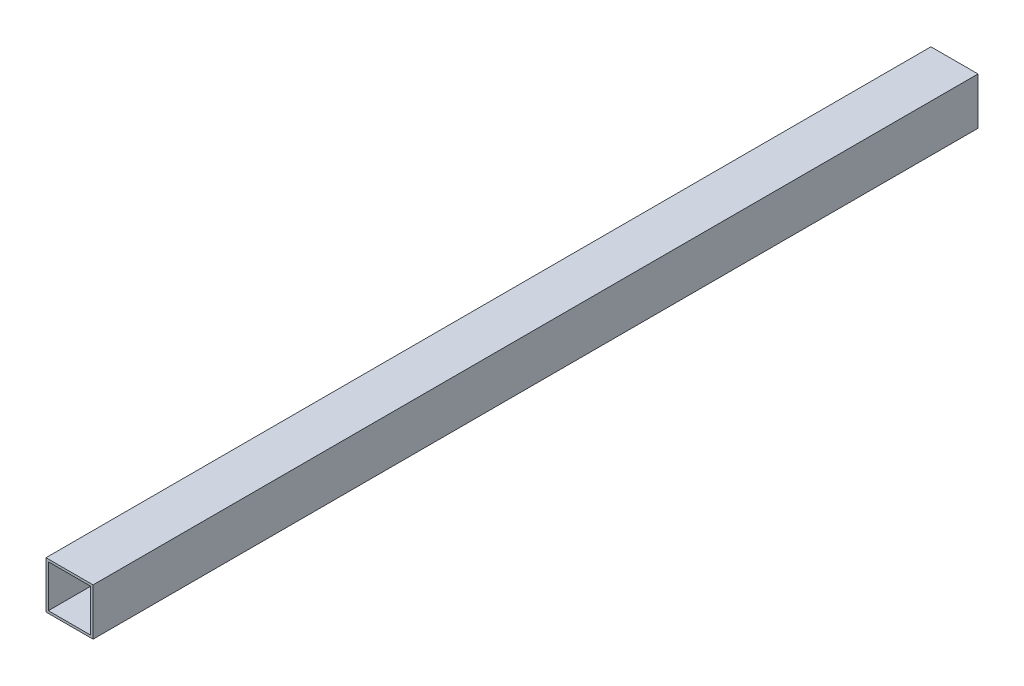
ISO-10303-21;
HEADER;
FILE_DESCRIPTION(('STEP AP214'),'2;1');
FILE_NAME('part.step','',(''),(''),'','','');
FILE_SCHEMA(('AUTOMOTIVE_DESIGN { 1 0 10303 214 1 1 1 1 }'));
ENDSEC;
DATA;
#1=APPLICATION_CONTEXT('core data for automotive mechanical design processes');
#2=APPLICATION_PROTOCOL_DEFINITION('international standard','automotive_design',2000,#1);
#3=PRODUCT_CONTEXT('',#1,'mechanical');
#4=PRODUCT('Part','Part','',(#3));
#5=PRODUCT_RELATED_PRODUCT_CATEGORY('part','',(#4));
#6=PRODUCT_DEFINITION_FORMATION('','',#4);
#7=PRODUCT_DEFINITION_CONTEXT('part definition',#1,'design');
#8=PRODUCT_DEFINITION('design','',#6,#7);
#9=PRODUCT_DEFINITION_SHAPE('','',#8);
#10=(LENGTH_UNIT() NAMED_UNIT(*) SI_UNIT(.MILLI.,.METRE.));
#11=(NAMED_UNIT(*) PLANE_ANGLE_UNIT() SI_UNIT($,.RADIAN.));
#12=(NAMED_UNIT(*) SI_UNIT($,.STERADIAN.) SOLID_ANGLE_UNIT());
#13=UNCERTAINTY_MEASURE_WITH_UNIT(LENGTH_MEASURE(1.E-05),#10,'distance_accuracy_value','');
#14=(GEOMETRIC_REPRESENTATION_CONTEXT(3) GLOBAL_UNCERTAINTY_ASSIGNED_CONTEXT((#13)) GLOBAL_UNIT_ASSIGNED_CONTEXT((#10,
#11,#12)) REPRESENTATION_CONTEXT('',''));
#15=CARTESIAN_POINT('',(0.,0.,0.));
#16=DIRECTION('',(0.,0.,1.));
#17=DIRECTION('',(1.,0.,0.));
#18=AXIS2_PLACEMENT_3D('',#15,#16,#17);
#19=CARTESIAN_POINT('',(0.,0.,940.));
#20=DIRECTION('',(0.,0.,-1.));
#21=DIRECTION('',(-1.,0.,0.));
#22=AXIS2_PLACEMENT_3D('',#19,#20,#21);
#23=PLANE('',#22);
#24=DIRECTION('',(0.,-1.,0.));
#25=VECTOR('',#24,1.);
#26=CARTESIAN_POINT('',(-50.,-50.,940.));
#27=LINE('',#26,#25);
#28=CARTESIAN_POINT('',(-50.,49.9999999999999,940.));
#29=VERTEX_POINT('',#28);
#30=CARTESIAN_POINT('',(-50.,-50.,940.));
#31=VERTEX_POINT('',#30);
#32=EDGE_CURVE('E166',#29,#31,#27,.T.);
#33=ORIENTED_EDGE('',*,*,#32,.T.);
#34=DIRECTION('',(1.,0.,0.));
#35=VECTOR('',#34,1.);
#36=CARTESIAN_POINT('',(-50.,-50.,940.));
#37=LINE('',#36,#35);
#38=CARTESIAN_POINT('',(50.,-50.,940.));
#39=VERTEX_POINT('',#38);
#40=EDGE_CURVE('E170',#31,#39,#37,.T.);
#41=ORIENTED_EDGE('',*,*,#40,.T.);
#42=DIRECTION('',(0.,1.,0.));
#43=VECTOR('',#42,1.);
#44=CARTESIAN_POINT('',(50.,-50.,940.));
#45=LINE('',#44,#43);
#46=CARTESIAN_POINT('',(49.9999999999999,49.9999999999999,940.));
#47=VERTEX_POINT('',#46);
#48=EDGE_CURVE('E174',#39,#47,#45,.T.);
#49=ORIENTED_EDGE('',*,*,#48,.T.);
#50=DIRECTION('',(-1.,0.,0.));
#51=VECTOR('',#50,1.);
#52=CARTESIAN_POINT('',(-50.,49.9999999999999,940.));
#53=LINE('',#52,#51);
#54=EDGE_CURVE('E177',#47,#29,#53,.T.);
#55=ORIENTED_EDGE('',*,*,#54,.T.);
#56=EDGE_LOOP('',(#33,#41,#49,#55));
#57=FACE_BOUND('',#56,.T.);
#58=DIRECTION('',(0.,-1.,0.));
#59=VECTOR('',#58,1.);
#60=CARTESIAN_POINT('',(-45.,-45.,940.));
#61=LINE('',#60,#59);
#62=CARTESIAN_POINT('',(-45.,44.9999999999999,940.));
#63=VERTEX_POINT('',#62);
#64=CARTESIAN_POINT('',(-45.,-45.,940.));
#65=VERTEX_POINT('',#64);
#66=EDGE_CURVE('E117',#63,#65,#61,.T.);
#67=ORIENTED_EDGE('',*,*,#66,.F.);
#68=DIRECTION('',(-1.,0.,0.));
#69=VECTOR('',#68,1.);
#70=CARTESIAN_POINT('',(-45.,44.9999999999999,940.));
#71=LINE('',#70,#69);
#72=CARTESIAN_POINT('',(45.,44.9999999999999,940.));
#73=VERTEX_POINT('',#72);
#74=EDGE_CURVE('E144',#73,#63,#71,.T.);
#75=ORIENTED_EDGE('',*,*,#74,.F.);
#76=DIRECTION('',(0.,1.,0.));
#77=VECTOR('',#76,1.);
#78=CARTESIAN_POINT('',(45.,-45.,940.));
#79=LINE('',#78,#77);
#80=CARTESIAN_POINT('',(45.,-45.,940.));
#81=VERTEX_POINT('',#80);
#82=EDGE_CURVE('E139',#81,#73,#79,.T.);
#83=ORIENTED_EDGE('',*,*,#82,.F.);
#84=DIRECTION('',(1.,0.,0.));
#85=VECTOR('',#84,1.);
#86=CARTESIAN_POINT('',(-45.,-45.,940.));
#87=LINE('',#86,#85);
#88=EDGE_CURVE('E126',#65,#81,#87,.T.);
#89=ORIENTED_EDGE('',*,*,#88,.F.);
#90=EDGE_LOOP('',(#67,#75,#83,#89));
#91=FACE_BOUND('',#90,.T.);
#92=ADVANCED_FACE('F39',(#57,#91),#23,.F.);
#93=CARTESIAN_POINT('',(0.,0.,-940.));
#94=DIRECTION('',(0.,0.,-1.));
#95=DIRECTION('',(-1.,0.,0.));
#96=AXIS2_PLACEMENT_3D('',#93,#94,#95);
#97=PLANE('',#96);
#98=DIRECTION('',(0.,-1.,0.));
#99=VECTOR('',#98,1.);
#100=CARTESIAN_POINT('',(-50.,-50.,-940.));
#101=LINE('',#100,#99);
#102=CARTESIAN_POINT('',(-50.,49.9999999999999,-940.));
#103=VERTEX_POINT('',#102);
#104=CARTESIAN_POINT('',(-50.,-50.,-940.));
#105=VERTEX_POINT('',#104);
#106=EDGE_CURVE('E135',#103,#105,#101,.T.);
#107=ORIENTED_EDGE('',*,*,#106,.F.);
#108=DIRECTION('',(-1.,0.,0.));
#109=VECTOR('',#108,1.);
#110=CARTESIAN_POINT('',(-50.,49.9999999999999,-940.));
#111=LINE('',#110,#109);
#112=CARTESIAN_POINT('',(49.9999999999999,49.9999999999999,-940.));
#113=VERTEX_POINT('',#112);
#114=EDGE_CURVE('E171',#113,#103,#111,.T.);
#115=ORIENTED_EDGE('',*,*,#114,.F.);
#116=DIRECTION('',(0.,1.,0.));
#117=VECTOR('',#116,1.);
#118=CARTESIAN_POINT('',(50.,-50.,-940.));
#119=LINE('',#118,#117);
#120=CARTESIAN_POINT('',(50.,-50.,-940.));
#121=VERTEX_POINT('',#120);
#122=EDGE_CURVE('E187',#121,#113,#119,.T.);
#123=ORIENTED_EDGE('',*,*,#122,.F.);
#124=DIRECTION('',(1.,0.,0.));
#125=VECTOR('',#124,1.);
#126=CARTESIAN_POINT('',(-50.,-50.,-940.));
#127=LINE('',#126,#125);
#128=EDGE_CURVE('E184',#105,#121,#127,.T.);
#129=ORIENTED_EDGE('',*,*,#128,.F.);
#130=EDGE_LOOP('',(#107,#115,#123,#129));
#131=FACE_BOUND('',#130,.T.);
#132=DIRECTION('',(-1.,0.,0.));
#133=VECTOR('',#132,1.);
#134=CARTESIAN_POINT('',(-45.,44.9999999999999,-940.));
#135=LINE('',#134,#133);
#136=CARTESIAN_POINT('',(45.,44.9999999999999,-940.));
#137=VERTEX_POINT('',#136);
#138=CARTESIAN_POINT('',(-45.,44.9999999999999,-940.));
#139=VERTEX_POINT('',#138);
#140=EDGE_CURVE('E127',#137,#139,#135,.T.);
#141=ORIENTED_EDGE('',*,*,#140,.T.);
#142=DIRECTION('',(0.,-1.,0.));
#143=VECTOR('',#142,1.);
#144=CARTESIAN_POINT('',(-45.,-45.,-940.));
#145=LINE('',#144,#143);
#146=CARTESIAN_POINT('',(-45.,-45.,-940.));
#147=VERTEX_POINT('',#146);
#148=EDGE_CURVE('E69',#139,#147,#145,.T.);
#149=ORIENTED_EDGE('',*,*,#148,.T.);
#150=DIRECTION('',(1.,0.,0.));
#151=VECTOR('',#150,1.);
#152=CARTESIAN_POINT('',(-45.,-45.,-940.));
#153=LINE('',#152,#151);
#154=CARTESIAN_POINT('',(45.,-45.,-940.));
#155=VERTEX_POINT('',#154);
#156=EDGE_CURVE('E133',#147,#155,#153,.T.);
#157=ORIENTED_EDGE('',*,*,#156,.T.);
#158=DIRECTION('',(0.,1.,0.));
#159=VECTOR('',#158,1.);
#160=CARTESIAN_POINT('',(45.,-45.,-940.));
#161=LINE('',#160,#159);
#162=EDGE_CURVE('E153',#155,#137,#161,.T.);
#163=ORIENTED_EDGE('',*,*,#162,.T.);
#164=EDGE_LOOP('',(#141,#149,#157,#163));
#165=FACE_BOUND('',#164,.T.);
#166=ADVANCED_FACE('F209',(#131,#165),#97,.T.);
#167=CARTESIAN_POINT('',(-50.,-50.,940.));
#168=DIRECTION('',(1.,0.,0.));
#169=DIRECTION('',(0.,0.,-1.));
#170=AXIS2_PLACEMENT_3D('',#167,#168,#169);
#171=PLANE('',#170);
#172=ORIENTED_EDGE('',*,*,#106,.T.);
#173=DIRECTION('',(0.,0.,-1.));
#174=VECTOR('',#173,1.);
#175=CARTESIAN_POINT('',(-50.,-50.,940.));
#176=LINE('',#175,#174);
#177=EDGE_CURVE('E11',#31,#105,#176,.T.);
#178=ORIENTED_EDGE('',*,*,#177,.F.);
#179=ORIENTED_EDGE('',*,*,#32,.F.);
#180=DIRECTION('',(0.,0.,-1.));
#181=VECTOR('',#180,1.);
#182=CARTESIAN_POINT('',(-50.,49.9999999999999,940.));
#183=LINE('',#182,#181);
#184=EDGE_CURVE('E180',#29,#103,#183,.T.);
#185=ORIENTED_EDGE('',*,*,#184,.T.);
#186=EDGE_LOOP('',(#172,#178,#179,#185));
#187=FACE_BOUND('',#186,.T.);
#188=ADVANCED_FACE('F41',(#187),#171,.F.);
#189=CARTESIAN_POINT('',(-50.,-50.,940.));
#190=DIRECTION('',(0.,1.,0.));
#191=DIRECTION('',(0.,0.,1.));
#192=AXIS2_PLACEMENT_3D('',#189,#190,#191);
#193=PLANE('',#192);
#194=ORIENTED_EDGE('',*,*,#128,.T.);
#195=DIRECTION('',(0.,0.,-1.));
#196=VECTOR('',#195,1.);
#197=CARTESIAN_POINT('',(50.,-50.,940.));
#198=LINE('',#197,#196);
#199=EDGE_CURVE('E48',#39,#121,#198,.T.);
#200=ORIENTED_EDGE('',*,*,#199,.F.);
#201=ORIENTED_EDGE('',*,*,#40,.F.);
#202=ORIENTED_EDGE('',*,*,#177,.T.);
#203=EDGE_LOOP('',(#194,#200,#201,#202));
#204=FACE_BOUND('',#203,.T.);
#205=ADVANCED_FACE('F219',(#204),#193,.F.);
#206=CARTESIAN_POINT('',(50.,-50.,940.));
#207=DIRECTION('',(-1.,0.,0.));
#208=DIRECTION('',(0.,-1.,0.));
#209=AXIS2_PLACEMENT_3D('',#206,#207,#208);
#210=PLANE('',#209);
#211=ORIENTED_EDGE('',*,*,#122,.T.);
#212=DIRECTION('',(0.,0.,-1.));
#213=VECTOR('',#212,1.);
#214=CARTESIAN_POINT('',(49.9999999999999,49.9999999999999,940.));
#215=LINE('',#214,#213);
#216=EDGE_CURVE('E194',#47,#113,#215,.T.);
#217=ORIENTED_EDGE('',*,*,#216,.F.);
#218=ORIENTED_EDGE('',*,*,#48,.F.);
#219=ORIENTED_EDGE('',*,*,#199,.T.);
#220=EDGE_LOOP('',(#211,#217,#218,#219));
#221=FACE_BOUND('',#220,.T.);
#222=ADVANCED_FACE('F203',(#221),#210,.F.);
#223=CARTESIAN_POINT('',(-50.,49.9999999999999,940.));
#224=DIRECTION('',(0.,-1.,0.));
#225=DIRECTION('',(0.,0.,-1.));
#226=AXIS2_PLACEMENT_3D('',#223,#224,#225);
#227=PLANE('',#226);
#228=ORIENTED_EDGE('',*,*,#114,.T.);
#229=ORIENTED_EDGE('',*,*,#184,.F.);
#230=ORIENTED_EDGE('',*,*,#54,.F.);
#231=ORIENTED_EDGE('',*,*,#216,.T.);
#232=EDGE_LOOP('',(#228,#229,#230,#231));
#233=FACE_BOUND('',#232,.T.);
#234=ADVANCED_FACE('F213',(#233),#227,.F.);
#235=CARTESIAN_POINT('',(-45.,-45.,940.));
#236=DIRECTION('',(1.,0.,0.));
#237=DIRECTION('',(0.,0.,-1.));
#238=AXIS2_PLACEMENT_3D('',#235,#236,#237);
#239=PLANE('',#238);
#240=ORIENTED_EDGE('',*,*,#148,.F.);
#241=DIRECTION('',(0.,0.,-1.));
#242=VECTOR('',#241,1.);
#243=CARTESIAN_POINT('',(-45.,44.9999999999999,940.));
#244=LINE('',#243,#242);
#245=EDGE_CURVE('E121',#63,#139,#244,.T.);
#246=ORIENTED_EDGE('',*,*,#245,.F.);
#247=ORIENTED_EDGE('',*,*,#66,.T.);
#248=DIRECTION('',(0.,0.,-1.));
#249=VECTOR('',#248,1.);
#250=CARTESIAN_POINT('',(-45.,-45.,940.));
#251=LINE('',#250,#249);
#252=EDGE_CURVE('E120',#65,#147,#251,.T.);
#253=ORIENTED_EDGE('',*,*,#252,.T.);
#254=EDGE_LOOP('',(#240,#246,#247,#253));
#255=FACE_BOUND('',#254,.T.);
#256=ADVANCED_FACE('F119',(#255),#239,.T.);
#257=CARTESIAN_POINT('',(-45.,-45.,940.));
#258=DIRECTION('',(0.,1.,0.));
#259=DIRECTION('',(0.,0.,1.));
#260=AXIS2_PLACEMENT_3D('',#257,#258,#259);
#261=PLANE('',#260);
#262=ORIENTED_EDGE('',*,*,#156,.F.);
#263=ORIENTED_EDGE('',*,*,#252,.F.);
#264=ORIENTED_EDGE('',*,*,#88,.T.);
#265=DIRECTION('',(0.,0.,-1.));
#266=VECTOR('',#265,1.);
#267=CARTESIAN_POINT('',(45.,-45.,940.));
#268=LINE('',#267,#266);
#269=EDGE_CURVE('E136',#81,#155,#268,.T.);
#270=ORIENTED_EDGE('',*,*,#269,.T.);
#271=EDGE_LOOP('',(#262,#263,#264,#270));
#272=FACE_BOUND('',#271,.T.);
#273=ADVANCED_FACE('F130',(#272),#261,.T.);
#274=CARTESIAN_POINT('',(45.,-45.,940.));
#275=DIRECTION('',(-1.,0.,0.));
#276=DIRECTION('',(0.,-1.,0.));
#277=AXIS2_PLACEMENT_3D('',#274,#275,#276);
#278=PLANE('',#277);
#279=ORIENTED_EDGE('',*,*,#162,.F.);
#280=ORIENTED_EDGE('',*,*,#269,.F.);
#281=ORIENTED_EDGE('',*,*,#82,.T.);
#282=DIRECTION('',(0.,0.,-1.));
#283=VECTOR('',#282,1.);
#284=CARTESIAN_POINT('',(45.,44.9999999999999,940.));
#285=LINE('',#284,#283);
#286=EDGE_CURVE('E58',#73,#137,#285,.T.);
#287=ORIENTED_EDGE('',*,*,#286,.T.);
#288=EDGE_LOOP('',(#279,#280,#281,#287));
#289=FACE_BOUND('',#288,.T.);
#290=ADVANCED_FACE('F242',(#289),#278,.T.);
#291=CARTESIAN_POINT('',(-45.,44.9999999999999,940.));
#292=DIRECTION('',(0.,-1.,0.));
#293=DIRECTION('',(0.,0.,-1.));
#294=AXIS2_PLACEMENT_3D('',#291,#292,#293);
#295=PLANE('',#294);
#296=ORIENTED_EDGE('',*,*,#140,.F.);
#297=ORIENTED_EDGE('',*,*,#286,.F.);
#298=ORIENTED_EDGE('',*,*,#74,.T.);
#299=ORIENTED_EDGE('',*,*,#245,.T.);
#300=EDGE_LOOP('',(#296,#297,#298,#299));
#301=FACE_BOUND('',#300,.T.);
#302=ADVANCED_FACE('F246',(#301),#295,.T.);
#303=CLOSED_SHELL('',(#92,#166,#188,#205,#222,#234,#256,#273,#290,#302));
#304=MANIFOLD_SOLID_BREP('B2',#303);
#305=ADVANCED_BREP_SHAPE_REPRESENTATION('',(#18,#304),#14);
#306=SHAPE_DEFINITION_REPRESENTATION(#9,#305);
ENDSEC;
END-ISO-10303-21;
